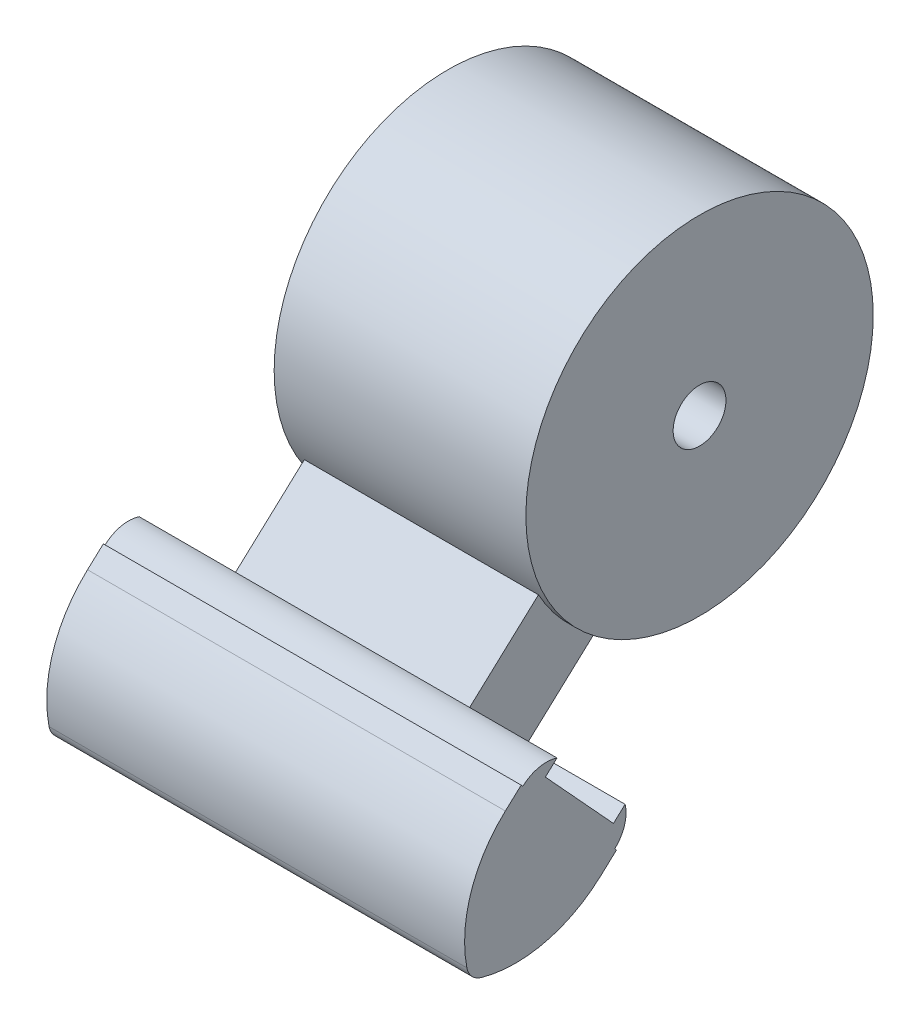
ISO-10303-21;
HEADER;
FILE_DESCRIPTION(('STEP AP214'),'2;1');
FILE_NAME('part.step','',(''),(''),'','','');
FILE_SCHEMA(('AUTOMOTIVE_DESIGN { 1 0 10303 214 1 1 1 1 }'));
ENDSEC;
DATA;
#1=APPLICATION_CONTEXT('core data for automotive mechanical design processes');
#2=APPLICATION_PROTOCOL_DEFINITION('international standard','automotive_design',2000,#1);
#3=PRODUCT_CONTEXT('',#1,'mechanical');
#4=PRODUCT('Part','Part','',(#3));
#5=PRODUCT_RELATED_PRODUCT_CATEGORY('part','',(#4));
#6=PRODUCT_DEFINITION_FORMATION('','',#4);
#7=PRODUCT_DEFINITION_CONTEXT('part definition',#1,'design');
#8=PRODUCT_DEFINITION('design','',#6,#7);
#9=PRODUCT_DEFINITION_SHAPE('','',#8);
#10=(LENGTH_UNIT() NAMED_UNIT(*) SI_UNIT(.MILLI.,.METRE.));
#11=(NAMED_UNIT(*) PLANE_ANGLE_UNIT() SI_UNIT($,.RADIAN.));
#12=(NAMED_UNIT(*) SI_UNIT($,.STERADIAN.) SOLID_ANGLE_UNIT());
#13=UNCERTAINTY_MEASURE_WITH_UNIT(LENGTH_MEASURE(1.E-05),#10,'distance_accuracy_value','');
#14=(GEOMETRIC_REPRESENTATION_CONTEXT(3) GLOBAL_UNCERTAINTY_ASSIGNED_CONTEXT((#13)) GLOBAL_UNIT_ASSIGNED_CONTEXT((#10,
#11,#12)) REPRESENTATION_CONTEXT('',''));
#15=CARTESIAN_POINT('',(0.,0.,0.));
#16=DIRECTION('',(0.,0.,1.));
#17=DIRECTION('',(1.,0.,0.));
#18=AXIS2_PLACEMENT_3D('',#15,#16,#17);
#19=CARTESIAN_POINT('',(1.050063098956,28.9739788111902,0.383786811994563));
#20=DIRECTION('',(0.,0.676118342877555,-0.736793041786165));
#21=DIRECTION('',(0.,0.736793041786165,0.676118342877555));
#22=AXIS2_PLACEMENT_3D('',#19,#20,#21);
#23=PLANE('',#22);
#24=DIRECTION('',(-1.,0.,0.));
#25=VECTOR('',#24,1.);
#26=CARTESIAN_POINT('',(1.050063098956,28.973978811191,0.383786811995052));
#27=LINE('',#26,#25);
#28=CARTESIAN_POINT('',(1.050063098956,28.9739788111909,0.383786811995115));
#29=VERTEX_POINT('',#28);
#30=CARTESIAN_POINT('',(17.650063098956,28.9739788111909,0.383786811995115));
#31=VERTEX_POINT('',#30);
#32=EDGE_CURVE('E139',#29,#31,#27,.F.);
#33=ORIENTED_EDGE('',*,*,#32,.F.);
#34=DIRECTION('',(0.,0.736793041786165,0.676118342877555));
#35=VECTOR('',#34,1.);
#36=CARTESIAN_POINT('',(1.050063098956,28.9739788111902,0.383786811994563));
#37=LINE('',#36,#35);
#38=CARTESIAN_POINT('',(1.050063098956,29.0476581153687,0.45139864628238));
#39=VERTEX_POINT('',#38);
#40=EDGE_CURVE('E148',#29,#39,#37,.T.);
#41=ORIENTED_EDGE('',*,*,#40,.T.);
#42=DIRECTION('',(1.,0.,0.));
#43=VECTOR('',#42,1.);
#44=CARTESIAN_POINT('',(1.050063098956,29.0476581153686,0.451398646282431));
#45=LINE('',#44,#43);
#46=CARTESIAN_POINT('',(17.650063098956,29.0476581153687,0.45139864628238));
#47=VERTEX_POINT('',#46);
#48=EDGE_CURVE('E158',#47,#39,#45,.F.);
#49=ORIENTED_EDGE('',*,*,#48,.F.);
#50=DIRECTION('',(0.,0.736793041786165,0.676118342877555));
#51=VECTOR('',#50,1.);
#52=CARTESIAN_POINT('',(17.650063098956,28.9739788111902,0.383786811994563));
#53=LINE('',#52,#51);
#54=EDGE_CURVE('E152',#47,#31,#53,.F.);
#55=ORIENTED_EDGE('',*,*,#54,.T.);
#56=EDGE_LOOP('',(#33,#41,#49,#55));
#57=FACE_BOUND('',#56,.T.);
#58=ADVANCED_FACE('F16',(#57),#23,.T.);
#59=CARTESIAN_POINT('',(1.050063098956,24.9216170813654,-3.33486407383129));
#60=DIRECTION('',(0.,0.676118342877555,-0.736793041786165));
#61=DIRECTION('',(0.,0.736793041786165,0.676118342877555));
#62=AXIS2_PLACEMENT_3D('',#59,#60,#61);
#63=PLANE('',#62);
#64=DIRECTION('',(1.,0.,0.));
#65=VECTOR('',#64,1.);
#66=CARTESIAN_POINT('',(1.050063098956,24.9216170813658,-3.33486407383002));
#67=LINE('',#66,#65);
#68=CARTESIAN_POINT('',(1.050063098956,24.9216170813657,-3.33486407383045));
#69=VERTEX_POINT('',#68);
#70=CARTESIAN_POINT('',(17.650063098956,24.9216170813657,-3.33486407383045));
#71=VERTEX_POINT('',#70);
#72=EDGE_CURVE('E164',#69,#71,#67,.T.);
#73=ORIENTED_EDGE('',*,*,#72,.F.);
#74=DIRECTION('',(0.,0.736793041786165,0.676118342877555));
#75=VECTOR('',#74,1.);
#76=CARTESIAN_POINT('',(1.050063098956,24.9216170813654,-3.33486407383129));
#77=LINE('',#76,#75);
#78=CARTESIAN_POINT('',(1.050063098956,24.995296385544,-3.26725223954586));
#79=VERTEX_POINT('',#78);
#80=EDGE_CURVE('E168',#69,#79,#77,.T.);
#81=ORIENTED_EDGE('',*,*,#80,.T.);
#82=DIRECTION('',(-1.,0.,0.));
#83=VECTOR('',#82,1.);
#84=CARTESIAN_POINT('',(1.050063098956,24.9952963855451,-3.2672522395471));
#85=LINE('',#84,#83);
#86=CARTESIAN_POINT('',(17.650063098956,24.995296385544,-3.26725223954586));
#87=VERTEX_POINT('',#86);
#88=EDGE_CURVE('E134',#87,#79,#85,.T.);
#89=ORIENTED_EDGE('',*,*,#88,.F.);
#90=DIRECTION('',(0.,0.736793041786165,0.676118342877555));
#91=VECTOR('',#90,1.);
#92=CARTESIAN_POINT('',(17.650063098956,24.9216170813654,-3.33486407383129));
#93=LINE('',#92,#91);
#94=EDGE_CURVE('E151',#87,#71,#93,.F.);
#95=ORIENTED_EDGE('',*,*,#94,.T.);
#96=EDGE_LOOP('',(#73,#81,#89,#95));
#97=FACE_BOUND('',#96,.T.);
#98=ADVANCED_FACE('F263',(#97),#63,.T.);
#99=CARTESIAN_POINT('',(1.050063098956,24.3453673432341,-2.70690182157172));
#100=DIRECTION('',(0.,-0.736793041786165,-0.676118342877555));
#101=DIRECTION('',(0.,0.676118342877555,-0.736793041786165));
#102=AXIS2_PLACEMENT_3D('',#99,#100,#101);
#103=PLANE('',#102);
#104=DIRECTION('',(-1.,0.,0.));
#105=VECTOR('',#104,1.);
#106=CARTESIAN_POINT('',(1.050063098956,24.345367343216,-2.70690182155276));
#107=LINE('',#106,#105);
#108=CARTESIAN_POINT('',(1.050063098956,24.3453673432248,-2.70690182156195));
#109=VERTEX_POINT('',#108);
#110=CARTESIAN_POINT('',(17.650063098956,24.3453673432248,-2.70690182156195));
#111=VERTEX_POINT('',#110);
#112=EDGE_CURVE('E117',#109,#111,#107,.F.);
#113=ORIENTED_EDGE('',*,*,#112,.F.);
#114=DIRECTION('',(0.,0.676118342877555,-0.736793041786165));
#115=VECTOR('',#114,1.);
#116=CARTESIAN_POINT('',(1.050063098956,24.3453673432341,-2.70690182157172));
#117=LINE('',#116,#115);
#118=EDGE_CURVE('E242',#109,#69,#117,.T.);
#119=ORIENTED_EDGE('',*,*,#118,.T.);
#120=ORIENTED_EDGE('',*,*,#72,.T.);
#121=DIRECTION('',(0.,0.676118342877555,-0.736793041786165));
#122=VECTOR('',#121,1.);
#123=CARTESIAN_POINT('',(17.650063098956,24.3453673432341,-2.70690182157172));
#124=LINE('',#123,#122);
#125=EDGE_CURVE('E167',#71,#111,#124,.F.);
#126=ORIENTED_EDGE('',*,*,#125,.T.);
#127=EDGE_LOOP('',(#113,#119,#120,#126));
#128=FACE_BOUND('',#127,.T.);
#129=ADVANCED_FACE('F550',(#128),#103,.T.);
#130=CARTESIAN_POINT('',(1.050063098956,29.0476581153686,0.451398646282431));
#131=DIRECTION('',(0.,0.736793041786165,0.676118342877555));
#132=DIRECTION('',(0.,-0.676118342877555,0.736793041786165));
#133=AXIS2_PLACEMENT_3D('',#130,#131,#132);
#134=PLANE('',#133);
#135=ORIENTED_EDGE('',*,*,#48,.T.);
#136=DIRECTION('',(0.,-0.676118342877555,0.736793041786165));
#137=VECTOR('',#136,1.);
#138=CARTESIAN_POINT('',(1.050063098956,29.0476581153686,0.451398646282431));
#139=LINE('',#138,#137);
#140=CARTESIAN_POINT('',(1.050063098956,28.4714083772355,1.07936089854193));
#141=VERTEX_POINT('',#140);
#142=EDGE_CURVE('E109',#39,#141,#139,.T.);
#143=ORIENTED_EDGE('',*,*,#142,.T.);
#144=DIRECTION('',(-1.,0.,0.));
#145=VECTOR('',#144,1.);
#146=CARTESIAN_POINT('',(1.050063098956,28.471408377237,1.07936089853991));
#147=LINE('',#146,#145);
#148=CARTESIAN_POINT('',(17.650063098956,28.4714083772355,1.07936089854193));
#149=VERTEX_POINT('',#148);
#150=EDGE_CURVE('E116',#149,#141,#147,.T.);
#151=ORIENTED_EDGE('',*,*,#150,.F.);
#152=DIRECTION('',(0.,-0.676118342877555,0.736793041786165));
#153=VECTOR('',#152,1.);
#154=CARTESIAN_POINT('',(17.650063098956,29.0476581153686,0.451398646282431));
#155=LINE('',#154,#153);
#156=EDGE_CURVE('E161',#149,#47,#155,.F.);
#157=ORIENTED_EDGE('',*,*,#156,.T.);
#158=EDGE_LOOP('',(#135,#143,#151,#157));
#159=FACE_BOUND('',#158,.T.);
#160=ADVANCED_FACE('F288',(#159),#134,.T.);
#161=CARTESIAN_POINT('',(17.70510978832,23.9894333394197,1.82226046133782));
#162=DIRECTION('',(1.,0.,0.));
#163=DIRECTION('',(0.,0.,-1.));
#164=AXIS2_PLACEMENT_3D('',#161,#162,#163);
#165=CYLINDRICAL_SURFACE('',#164,0.8);
#166=DIRECTION('',(-1.,0.,0.));
#167=VECTOR('',#166,1.);
#168=CARTESIAN_POINT('',(1.050063098956,23.8374314672666,2.6076873712816));
#169=LINE('',#168,#167);
#170=CARTESIAN_POINT('',(1.050063098956,23.837431467259,2.60768737127953));
#171=VERTEX_POINT('',#170);
#172=CARTESIAN_POINT('',(17.650063098956,23.837431467259,2.60768737127953));
#173=VERTEX_POINT('',#172);
#174=EDGE_CURVE('E128',#171,#173,#169,.F.);
#175=ORIENTED_EDGE('',*,*,#174,.F.);
#176=CARTESIAN_POINT('',(1.050063098956,23.9894333394197,1.82226046133782));
#177=DIRECTION('',(1.,0.,0.));
#178=DIRECTION('',(0.,0.,-1.));
#179=AXIS2_PLACEMENT_3D('',#176,#177,#178);
#180=CIRCLE('',#179,0.8);
#181=CARTESIAN_POINT('',(1.050063098956,23.2199287274706,2.04103580772868));
#182=VERTEX_POINT('',#181);
#183=EDGE_CURVE('E108',#171,#182,#180,.T.);
#184=ORIENTED_EDGE('',*,*,#183,.T.);
#185=DIRECTION('',(-1.,0.,0.));
#186=VECTOR('',#185,1.);
#187=CARTESIAN_POINT('',(1.050063098956,23.2199287274726,2.04103580773452));
#188=LINE('',#187,#186);
#189=CARTESIAN_POINT('',(17.650063098956,23.2199287274706,2.04103580772868));
#190=VERTEX_POINT('',#189);
#191=EDGE_CURVE('E111',#190,#182,#188,.T.);
#192=ORIENTED_EDGE('',*,*,#191,.F.);
#193=CARTESIAN_POINT('',(17.650063098956,23.9894333394197,1.82226046133782));
#194=DIRECTION('',(1.,0.,0.));
#195=DIRECTION('',(0.,0.,-1.));
#196=AXIS2_PLACEMENT_3D('',#193,#194,#195);
#197=CIRCLE('',#196,0.8);
#198=EDGE_CURVE('E19',#190,#173,#197,.F.);
#199=ORIENTED_EDGE('',*,*,#198,.T.);
#200=EDGE_LOOP('',(#175,#184,#192,#199));
#201=FACE_BOUND('',#200,.T.);
#202=ADVANCED_FACE('F112',(#201),#165,.T.);
#203=CARTESIAN_POINT('',(1.050063098956,27.9582569750147,-0.548290617828714));
#204=DIRECTION('',(-1.,0.,0.));
#205=DIRECTION('',(0.,0.,1.));
#206=AXIS2_PLACEMENT_3D('',#203,#204,#205);
#207=CYLINDRICAL_SURFACE('',#206,1.378571428571);
#208=DIRECTION('',(1.,0.,0.));
#209=VECTOR('',#208,1.);
#210=CARTESIAN_POINT('',(1.050063098956,29.269565693393,-0.973647678162819));
#211=LINE('',#210,#209);
#212=CARTESIAN_POINT('',(1.050063098956,29.2695656933933,-0.973647678162653));
#213=VERTEX_POINT('',#212);
#214=CARTESIAN_POINT('',(17.650063098956,29.2695656933933,-0.973647678162653));
#215=VERTEX_POINT('',#214);
#216=EDGE_CURVE('E123',#213,#215,#211,.T.);
#217=ORIENTED_EDGE('',*,*,#216,.F.);
#218=CARTESIAN_POINT('',(1.050063098956,27.9582569750147,-0.548290617828714));
#219=DIRECTION('',(-1.,0.,0.));
#220=DIRECTION('',(0.,0.,1.));
#221=AXIS2_PLACEMENT_3D('',#218,#219,#220);
#222=CIRCLE('',#221,1.378571428571);
#223=EDGE_CURVE('E135',#213,#29,#222,.F.);
#224=ORIENTED_EDGE('',*,*,#223,.T.);
#225=ORIENTED_EDGE('',*,*,#32,.T.);
#226=CARTESIAN_POINT('',(17.650063098956,27.9582569750147,-0.548290617828714));
#227=DIRECTION('',(-1.,0.,0.));
#228=DIRECTION('',(0.,0.,1.));
#229=AXIS2_PLACEMENT_3D('',#226,#227,#228);
#230=CIRCLE('',#229,1.378571428571);
#231=EDGE_CURVE('E138',#31,#215,#230,.T.);
#232=ORIENTED_EDGE('',*,*,#231,.T.);
#233=EDGE_LOOP('',(#217,#224,#225,#232));
#234=FACE_BOUND('',#233,.T.);
#235=ADVANCED_FACE('F290',(#234),#207,.T.);
#236=CARTESIAN_POINT('',(1.050063098956,26.0110182217183,-2.33517480971998));
#237=DIRECTION('',(-1.,0.,0.));
#238=DIRECTION('',(0.,0.,1.));
#239=AXIS2_PLACEMENT_3D('',#236,#237,#238);
#240=CYLINDRICAL_SURFACE('',#239,1.378571428571);
#241=ORIENTED_EDGE('',*,*,#88,.T.);
#242=CARTESIAN_POINT('',(1.050063098956,26.0110182217183,-2.33517480971998));
#243=DIRECTION('',(-1.,0.,0.));
#244=DIRECTION('',(0.,0.,1.));
#245=AXIS2_PLACEMENT_3D('',#242,#243,#244);
#246=CIRCLE('',#245,1.378571428571);
#247=CARTESIAN_POINT('',(1.050063098956,26.3223935262483,-3.67812104967182));
#248=VERTEX_POINT('',#247);
#249=EDGE_CURVE('E132',#79,#248,#246,.F.);
#250=ORIENTED_EDGE('',*,*,#249,.T.);
#251=DIRECTION('',(1.,0.,0.));
#252=VECTOR('',#251,1.);
#253=CARTESIAN_POINT('',(1.050063098956,26.3223935262478,-3.6781210496718));
#254=LINE('',#253,#252);
#255=CARTESIAN_POINT('',(17.650063098956,26.3223935262479,-3.67812104967192));
#256=VERTEX_POINT('',#255);
#257=EDGE_CURVE('E195',#256,#248,#254,.F.);
#258=ORIENTED_EDGE('',*,*,#257,.F.);
#259=CARTESIAN_POINT('',(17.650063098956,26.0110182217183,-2.33517480971998));
#260=DIRECTION('',(-1.,0.,0.));
#261=DIRECTION('',(0.,0.,1.));
#262=AXIS2_PLACEMENT_3D('',#259,#260,#261);
#263=CIRCLE('',#262,1.378571428571);
#264=EDGE_CURVE('E122',#87,#256,#263,.F.);
#265=ORIENTED_EDGE('',*,*,#264,.F.);
#266=EDGE_LOOP('',(#241,#250,#258,#265));
#267=FACE_BOUND('',#266,.T.);
#268=ADVANCED_FACE('F274',(#267),#240,.T.);
#269=CARTESIAN_POINT('',(1.050063098956,28.029332552164,0.673689892816268));
#270=DIRECTION('',(-1.,0.,0.));
#271=DIRECTION('',(0.,0.,1.));
#272=AXIS2_PLACEMENT_3D('',#269,#270,#271);
#273=CYLINDRICAL_SURFACE('',#272,5.);
#274=CARTESIAN_POINT('',(17.650063098956,28.029332552164,0.673689892816268));
#275=DIRECTION('',(-1.,0.,0.));
#276=DIRECTION('',(0.,0.,1.));
#277=AXIS2_PLACEMENT_3D('',#274,#275,#276);
#278=CIRCLE('',#277,5.);
#279=EDGE_CURVE('E102',#190,#111,#278,.F.);
#280=ORIENTED_EDGE('',*,*,#279,.F.);
#281=ORIENTED_EDGE('',*,*,#191,.T.);
#282=CARTESIAN_POINT('',(1.050063098956,28.029332552164,0.673689892816268));
#283=DIRECTION('',(-1.,0.,0.));
#284=DIRECTION('',(0.,0.,1.));
#285=AXIS2_PLACEMENT_3D('',#282,#283,#284);
#286=CIRCLE('',#285,5.);
#287=EDGE_CURVE('E193',#182,#109,#286,.F.);
#288=ORIENTED_EDGE('',*,*,#287,.T.);
#289=ORIENTED_EDGE('',*,*,#112,.T.);
#290=EDGE_LOOP('',(#280,#281,#288,#289));
#291=FACE_BOUND('',#290,.T.);
#292=ADVANCED_FACE('F120',(#291),#273,.T.);
#293=CARTESIAN_POINT('',(1.050063098956,24.7874431683028,-2.30123081584418));
#294=DIRECTION('',(-1.,0.,0.));
#295=DIRECTION('',(0.,0.,1.));
#296=AXIS2_PLACEMENT_3D('',#293,#294,#295);
#297=CYLINDRICAL_SURFACE('',#296,5.);
#298=CARTESIAN_POINT('',(1.050063098956,24.7874431683028,-2.30123081584418));
#299=DIRECTION('',(-1.,0.,0.));
#300=DIRECTION('',(0.,0.,1.));
#301=AXIS2_PLACEMENT_3D('',#298,#299,#300);
#302=CIRCLE('',#301,5.);
#303=EDGE_CURVE('E188',#141,#171,#302,.F.);
#304=ORIENTED_EDGE('',*,*,#303,.T.);
#305=ORIENTED_EDGE('',*,*,#174,.T.);
#306=CARTESIAN_POINT('',(17.650063098956,24.7874431683028,-2.30123081584418));
#307=DIRECTION('',(-1.,0.,0.));
#308=DIRECTION('',(0.,0.,1.));
#309=AXIS2_PLACEMENT_3D('',#306,#307,#308);
#310=CIRCLE('',#309,5.);
#311=EDGE_CURVE('E104',#149,#173,#310,.F.);
#312=ORIENTED_EDGE('',*,*,#311,.F.);
#313=ORIENTED_EDGE('',*,*,#150,.T.);
#314=EDGE_LOOP('',(#304,#305,#312,#313));
#315=FACE_BOUND('',#314,.T.);
#316=ADVANCED_FACE('F500',(#315),#297,.T.);
#317=CARTESIAN_POINT('',(1.050063098956,28.8436111373799,-0.509468061837339));
#318=DIRECTION('',(0.,-0.736793041786165,-0.676118342877555));
#319=DIRECTION('',(0.,0.676118342877555,-0.736793041786165));
#320=AXIS2_PLACEMENT_3D('',#317,#318,#319);
#321=PLANE('',#320);
#322=DIRECTION('',(1.,0.,0.));
#323=VECTOR('',#322,1.);
#324=CARTESIAN_POINT('',(1.050063098956,28.8436111373791,-0.509468061836153));
#325=LINE('',#324,#323);
#326=CARTESIAN_POINT('',(1.050063098956,28.8436111373791,-0.509468061836189));
#327=VERTEX_POINT('',#326);
#328=CARTESIAN_POINT('',(17.650063098956,28.8436111373791,-0.509468061836184));
#329=VERTEX_POINT('',#328);
#330=EDGE_CURVE('E191',#327,#329,#325,.T.);
#331=ORIENTED_EDGE('',*,*,#330,.F.);
#332=DIRECTION('',(0.,0.676118342878122,-0.736793041785644));
#333=VECTOR('',#332,1.);
#334=CARTESIAN_POINT('',(1.050063098956,28.8436111373791,-0.50946806183619));
#335=LINE('',#334,#333);
#336=EDGE_CURVE('E192',#327,#213,#335,.T.);
#337=ORIENTED_EDGE('',*,*,#336,.T.);
#338=ORIENTED_EDGE('',*,*,#216,.T.);
#339=DIRECTION('',(0.,0.676118342878122,-0.736793041785644));
#340=VECTOR('',#339,1.);
#341=CARTESIAN_POINT('',(17.650063098956,28.8436111373791,-0.50946806183619));
#342=LINE('',#341,#340);
#343=EDGE_CURVE('E125',#329,#215,#342,.T.);
#344=ORIENTED_EDGE('',*,*,#343,.F.);
#345=EDGE_LOOP('',(#331,#337,#338,#344));
#346=FACE_BOUND('',#345,.T.);
#347=ADVANCED_FACE('F294',(#346),#321,.T.);
#348=CARTESIAN_POINT('',(17.650063098956,34.91912593735,-9.935202041078));
#349=DIRECTION('',(1.,0.,0.));
#350=DIRECTION('',(0.,0.,-1.));
#351=AXIS2_PLACEMENT_3D('',#348,#349,#350);
#352=PLANE('',#351);
#353=ORIENTED_EDGE('',*,*,#311,.T.);
#354=ORIENTED_EDGE('',*,*,#198,.F.);
#355=ORIENTED_EDGE('',*,*,#279,.T.);
#356=ORIENTED_EDGE('',*,*,#125,.F.);
#357=ORIENTED_EDGE('',*,*,#94,.F.);
#358=ORIENTED_EDGE('',*,*,#264,.T.);
#359=DIRECTION('',(0.,-0.676118342877555,0.736793041786165));
#360=VECTOR('',#359,1.);
#361=CARTESIAN_POINT('',(17.650063098956,26.3223935262487,-3.67812104967283));
#362=LINE('',#361,#360);
#363=CARTESIAN_POINT('',(17.650063098956,25.8964389702341,-3.2139414333464));
#364=VERTEX_POINT('',#363);
#365=EDGE_CURVE('E196',#364,#256,#362,.F.);
#366=ORIENTED_EDGE('',*,*,#365,.F.);
#367=DIRECTION('',(0.,0.736793041786165,0.676118342877555));
#368=VECTOR('',#367,1.);
#369=CARTESIAN_POINT('',(17.650063098956,25.8964389702332,-3.21394143334747));
#370=LINE('',#369,#368);
#371=EDGE_CURVE('E215',#329,#364,#370,.F.);
#372=ORIENTED_EDGE('',*,*,#371,.F.);
#373=ORIENTED_EDGE('',*,*,#343,.T.);
#374=ORIENTED_EDGE('',*,*,#231,.F.);
#375=ORIENTED_EDGE('',*,*,#54,.F.);
#376=ORIENTED_EDGE('',*,*,#156,.F.);
#377=EDGE_LOOP('',(#353,#354,#355,#356,#357,#358,#366,#372,#373,#374,#375,#376));
#378=FACE_BOUND('',#377,.T.);
#379=ADVANCED_FACE('F99',(#378),#352,.T.);
#380=CARTESIAN_POINT('',(1.050063098956,26.3223935262487,-3.67812104967283));
#381=DIRECTION('',(0.,0.736793041786165,0.676118342877555));
#382=DIRECTION('',(0.,-0.676118342877555,0.736793041786165));
#383=AXIS2_PLACEMENT_3D('',#380,#381,#382);
#384=PLANE('',#383);
#385=ORIENTED_EDGE('',*,*,#257,.T.);
#386=DIRECTION('',(0.,-0.676118342879761,0.736793041784141));
#387=VECTOR('',#386,1.);
#388=CARTESIAN_POINT('',(1.050063098956,26.3223935262489,-3.67812104967185));
#389=LINE('',#388,#387);
#390=CARTESIAN_POINT('',(1.050063098956,25.8964389702338,-3.21394143334653));
#391=VERTEX_POINT('',#390);
#392=EDGE_CURVE('E194',#248,#391,#389,.T.);
#393=ORIENTED_EDGE('',*,*,#392,.T.);
#394=DIRECTION('',(1.,0.,0.));
#395=VECTOR('',#394,1.);
#396=CARTESIAN_POINT('',(1.050063098956,25.8964389702338,-3.21394143334694));
#397=LINE('',#396,#395);
#398=EDGE_CURVE('E222',#364,#391,#397,.F.);
#399=ORIENTED_EDGE('',*,*,#398,.F.);
#400=ORIENTED_EDGE('',*,*,#365,.T.);
#401=EDGE_LOOP('',(#385,#393,#399,#400));
#402=FACE_BOUND('',#401,.T.);
#403=ADVANCED_FACE('F474',(#402),#384,.T.);
#404=CARTESIAN_POINT('',(1.050063098956,34.91912593735,-9.935202041078));
#405=DIRECTION('',(1.,0.,0.));
#406=DIRECTION('',(0.,0.,-1.));
#407=AXIS2_PLACEMENT_3D('',#404,#405,#406);
#408=PLANE('',#407);
#409=ORIENTED_EDGE('',*,*,#142,.F.);
#410=ORIENTED_EDGE('',*,*,#40,.F.);
#411=ORIENTED_EDGE('',*,*,#223,.F.);
#412=ORIENTED_EDGE('',*,*,#336,.F.);
#413=DIRECTION('',(0.,0.736793041786165,0.676118342877555));
#414=VECTOR('',#413,1.);
#415=CARTESIAN_POINT('',(1.050063098956,25.8964389702332,-3.21394143334747));
#416=LINE('',#415,#414);
#417=EDGE_CURVE('E218',#391,#327,#416,.T.);
#418=ORIENTED_EDGE('',*,*,#417,.F.);
#419=ORIENTED_EDGE('',*,*,#392,.F.);
#420=ORIENTED_EDGE('',*,*,#249,.F.);
#421=ORIENTED_EDGE('',*,*,#80,.F.);
#422=ORIENTED_EDGE('',*,*,#118,.F.);
#423=ORIENTED_EDGE('',*,*,#287,.F.);
#424=ORIENTED_EDGE('',*,*,#183,.F.);
#425=ORIENTED_EDGE('',*,*,#303,.F.);
#426=EDGE_LOOP('',(#409,#410,#411,#412,#418,#419,#420,#421,#422,#423,#424,#425));
#427=FACE_BOUND('',#426,.T.);
#428=ADVANCED_FACE('F269',(#427),#408,.F.);
#429=CARTESIAN_POINT('',(1.050063098956,25.8964389702332,-3.21394143334747));
#430=DIRECTION('',(0.,0.676118342877555,-0.736793041786165));
#431=DIRECTION('',(0.,0.736793041786165,0.676118342877555));
#432=AXIS2_PLACEMENT_3D('',#429,#430,#431);
#433=PLANE('',#432);
#434=DIRECTION('',(0.,-0.736793041786275,-0.676118342877434));
#435=VECTOR('',#434,1.);
#436=CARTESIAN_POINT('',(4.700063098956,28.6594128769346,-0.678497647555615));
#437=LINE('',#436,#435);
#438=CARTESIAN_POINT('',(4.700063098956,28.6594128769346,-0.678497647555606));
#439=VERTEX_POINT('',#438);
#440=CARTESIAN_POINT('',(4.700063098956,26.2279958390402,-2.90968817905121));
#441=VERTEX_POINT('',#440);
#442=EDGE_CURVE('E303',#439,#441,#437,.T.);
#443=ORIENTED_EDGE('',*,*,#442,.T.);
#444=DIRECTION('',(1.,0.,0.));
#445=VECTOR('',#444,1.);
#446=CARTESIAN_POINT('',(1.050063098956,26.2279958390409,-2.90968817905132));
#447=LINE('',#446,#445);
#448=CARTESIAN_POINT('',(14.000063098956,26.2279958390409,-2.90968817905132));
#449=VERTEX_POINT('',#448);
#450=EDGE_CURVE('E221',#449,#441,#447,.F.);
#451=ORIENTED_EDGE('',*,*,#450,.F.);
#452=DIRECTION('',(0.,-0.736793041786114,-0.67611834287761));
#453=VECTOR('',#452,1.);
#454=CARTESIAN_POINT('',(14.000063098956,28.6594128769346,-0.678497647555615));
#455=LINE('',#454,#453);
#456=CARTESIAN_POINT('',(14.000063098956,28.6594128769346,-0.678497647555612));
#457=VERTEX_POINT('',#456);
#458=EDGE_CURVE('E314',#457,#449,#455,.T.);
#459=ORIENTED_EDGE('',*,*,#458,.F.);
#460=DIRECTION('',(1.,0.,0.));
#461=VECTOR('',#460,1.);
#462=CARTESIAN_POINT('',(1.050063098956,28.6594128769346,-0.678497647555606));
#463=LINE('',#462,#461);
#464=EDGE_CURVE('E309',#439,#457,#463,.T.);
#465=ORIENTED_EDGE('',*,*,#464,.F.);
#466=EDGE_LOOP('',(#443,#451,#459,#465));
#467=FACE_BOUND('',#466,.T.);
#468=ORIENTED_EDGE('',*,*,#398,.T.);
#469=ORIENTED_EDGE('',*,*,#417,.T.);
#470=ORIENTED_EDGE('',*,*,#330,.T.);
#471=ORIENTED_EDGE('',*,*,#371,.T.);
#472=EDGE_LOOP('',(#468,#469,#470,#471));
#473=FACE_BOUND('',#472,.T.);
#474=ADVANCED_FACE('F358',(#467,#473),#433,.T.);
#475=CARTESIAN_POINT('',(1.050063098956,26.2279958390409,-2.90968817905132));
#476=DIRECTION('',(0.,-0.736793041786165,-0.676118342877555));
#477=DIRECTION('',(0.,0.676118342877555,-0.736793041786165));
#478=AXIS2_PLACEMENT_3D('',#475,#476,#477);
#479=PLANE('',#478);
#480=ORIENTED_EDGE('',*,*,#450,.T.);
#481=DIRECTION('',(0.,0.676118342877569,-0.736793041786152));
#482=VECTOR('',#481,1.);
#483=CARTESIAN_POINT('',(4.700063098956,26.2279958390399,-2.90968817905116));
#484=LINE('',#483,#482);
#485=CARTESIAN_POINT('',(4.700063098956,29.1715636598076,-6.11741107433145));
#486=VERTEX_POINT('',#485);
#487=EDGE_CURVE('E306',#441,#486,#484,.T.);
#488=ORIENTED_EDGE('',*,*,#487,.T.);
#489=DIRECTION('',(-1.,0.,0.));
#490=VECTOR('',#489,1.);
#491=CARTESIAN_POINT('',(17.650063098956,29.1715636598076,-6.11741107433151));
#492=LINE('',#491,#490);
#493=CARTESIAN_POINT('',(14.000063098956,29.1715636598076,-6.11741107433145));
#494=VERTEX_POINT('',#493);
#495=EDGE_CURVE('E183',#494,#486,#492,.T.);
#496=ORIENTED_EDGE('',*,*,#495,.F.);
#497=DIRECTION('',(0.,0.676118342877465,-0.736793041786247));
#498=VECTOR('',#497,1.);
#499=CARTESIAN_POINT('',(14.000063098956,26.2279958390409,-2.90968817905132));
#500=LINE('',#499,#498);
#501=EDGE_CURVE('E187',#449,#494,#500,.T.);
#502=ORIENTED_EDGE('',*,*,#501,.F.);
#503=EDGE_LOOP('',(#480,#488,#496,#502));
#504=FACE_BOUND('',#503,.T.);
#505=ADVANCED_FACE('F362',(#504),#479,.T.);
#506=CARTESIAN_POINT('',(4.700063098956,34.91912593735,-9.935202041078));
#507=DIRECTION('',(1.,0.,0.));
#508=DIRECTION('',(0.,0.,-1.));
#509=AXIS2_PLACEMENT_3D('',#506,#507,#508);
#510=PLANE('',#509);
#511=CARTESIAN_POINT('',(4.700063098956,34.91912593735,-9.935202041078));
#512=DIRECTION('',(-1.,0.,0.));
#513=DIRECTION('',(0.,0.,1.));
#514=AXIS2_PLACEMENT_3D('',#511,#512,#513);
#515=CIRCLE('',#514,6.9);
#516=CARTESIAN_POINT('',(4.700063098956,31.6018199827701,-3.88495566562281));
#517=VERTEX_POINT('',#516);
#518=EDGE_CURVE('E180',#486,#517,#515,.T.);
#519=ORIENTED_EDGE('',*,*,#518,.F.);
#520=ORIENTED_EDGE('',*,*,#487,.F.);
#521=ORIENTED_EDGE('',*,*,#442,.F.);
#522=DIRECTION('',(0.,-0.676118342877555,0.736793041786165));
#523=VECTOR('',#522,1.);
#524=CARTESIAN_POINT('',(4.700063098956,31.6018199827709,-3.88495566562321));
#525=LINE('',#524,#523);
#526=EDGE_CURVE('E311',#517,#439,#525,.T.);
#527=ORIENTED_EDGE('',*,*,#526,.F.);
#528=EDGE_LOOP('',(#519,#520,#521,#527));
#529=FACE_BOUND('',#528,.T.);
#530=ADVANCED_FACE('F354',(#529),#510,.F.);
#531=CARTESIAN_POINT('',(1.050063098956,31.6018199827709,-3.88495566562321));
#532=DIRECTION('',(0.,0.736793041786165,0.676118342877555));
#533=DIRECTION('',(0.,-0.676118342877555,0.736793041786165));
#534=AXIS2_PLACEMENT_3D('',#531,#532,#533);
#535=PLANE('',#534);
#536=DIRECTION('',(-1.,0.,0.));
#537=VECTOR('',#536,1.);
#538=CARTESIAN_POINT('',(17.650063098956,31.6018199827698,-3.88495566562296));
#539=LINE('',#538,#537);
#540=CARTESIAN_POINT('',(14.000063098956,31.6018199827705,-3.88495566562262));
#541=VERTEX_POINT('',#540);
#542=EDGE_CURVE('E179',#517,#541,#539,.F.);
#543=ORIENTED_EDGE('',*,*,#542,.F.);
#544=ORIENTED_EDGE('',*,*,#526,.T.);
#545=ORIENTED_EDGE('',*,*,#464,.T.);
#546=DIRECTION('',(0.,-0.67611834287769,0.736793041786041));
#547=VECTOR('',#546,1.);
#548=CARTESIAN_POINT('',(14.000063098956,31.601819982771,-3.88495566562223));
#549=LINE('',#548,#547);
#550=EDGE_CURVE('E34',#541,#457,#549,.T.);
#551=ORIENTED_EDGE('',*,*,#550,.F.);
#552=EDGE_LOOP('',(#543,#544,#545,#551));
#553=FACE_BOUND('',#552,.T.);
#554=ADVANCED_FACE('F346',(#553),#535,.T.);
#555=CARTESIAN_POINT('',(14.000063098956,34.91912593735,-9.935202041078));
#556=DIRECTION('',(1.,0.,0.));
#557=DIRECTION('',(0.,0.,-1.));
#558=AXIS2_PLACEMENT_3D('',#555,#556,#557);
#559=PLANE('',#558);
#560=ORIENTED_EDGE('',*,*,#458,.T.);
#561=ORIENTED_EDGE('',*,*,#501,.T.);
#562=CARTESIAN_POINT('',(14.000063098956,34.91912593735,-9.935202041078));
#563=DIRECTION('',(-1.,0.,0.));
#564=DIRECTION('',(0.,0.,1.));
#565=AXIS2_PLACEMENT_3D('',#562,#563,#564);
#566=CIRCLE('',#565,6.9);
#567=EDGE_CURVE('E176',#541,#494,#566,.F.);
#568=ORIENTED_EDGE('',*,*,#567,.F.);
#569=ORIENTED_EDGE('',*,*,#550,.T.);
#570=EDGE_LOOP('',(#560,#561,#568,#569));
#571=FACE_BOUND('',#570,.T.);
#572=ADVANCED_FACE('F340',(#571),#559,.T.);
#573=CARTESIAN_POINT('',(14.350063098956,34.91912593735,-9.935202041078));
#574=DIRECTION('',(-1.,0.,0.));
#575=DIRECTION('',(0.,0.,1.));
#576=AXIS2_PLACEMENT_3D('',#573,#574,#575);
#577=CYLINDRICAL_SURFACE('',#576,1.05);
#578=CARTESIAN_POINT('',(14.350063098956,34.91912593735,-9.935202041078));
#579=DIRECTION('',(-1.,0.,0.));
#580=DIRECTION('',(0.,0.,1.));
#581=AXIS2_PLACEMENT_3D('',#578,#579,#580);
#582=CIRCLE('',#581,1.05);
#583=CARTESIAN_POINT('',(14.350063098956,34.91912593735,-8.885202041078));
#584=VERTEX_POINT('',#583);
#585=EDGE_CURVE('E184',#584,#584,#582,.F.);
#586=ORIENTED_EDGE('',*,*,#585,.T.);
#587=EDGE_LOOP('',(#586));
#588=FACE_BOUND('',#587,.T.);
#589=CARTESIAN_POINT('',(4.350063098956,34.91912593735,-9.935202041078));
#590=DIRECTION('',(-1.,0.,0.));
#591=DIRECTION('',(0.,0.,1.));
#592=AXIS2_PLACEMENT_3D('',#589,#590,#591);
#593=CIRCLE('',#592,1.05);
#594=CARTESIAN_POINT('',(4.350063098956,34.91912593735,-8.885202041078));
#595=VERTEX_POINT('',#594);
#596=EDGE_CURVE('E173',#595,#595,#593,.T.);
#597=ORIENTED_EDGE('',*,*,#596,.T.);
#598=EDGE_LOOP('',(#597));
#599=FACE_BOUND('',#598,.T.);
#600=ADVANCED_FACE('F386',(#588,#599),#577,.F.);
#601=CARTESIAN_POINT('',(14.350063098956,16.9058686392362,-14.609010521643));
#602=DIRECTION('',(-1.,0.,0.));
#603=DIRECTION('',(0.,0.,1.));
#604=AXIS2_PLACEMENT_3D('',#601,#602,#603);
#605=PLANE('',#604);
#606=ORIENTED_EDGE('',*,*,#585,.F.);
#607=EDGE_LOOP('',(#606));
#608=FACE_BOUND('',#607,.T.);
#609=CARTESIAN_POINT('',(14.350063098956,34.91912593735,-9.935202041078));
#610=DIRECTION('',(-1.,0.,0.));
#611=DIRECTION('',(0.,0.,1.));
#612=AXIS2_PLACEMENT_3D('',#609,#610,#611);
#613=CIRCLE('',#612,6.9);
#614=CARTESIAN_POINT('',(14.350063098956,34.91912593735,-3.035202041078));
#615=VERTEX_POINT('',#614);
#616=EDGE_CURVE('E25',#615,#615,#613,.T.);
#617=ORIENTED_EDGE('',*,*,#616,.F.);
#618=EDGE_LOOP('',(#617));
#619=FACE_BOUND('',#618,.T.);
#620=ADVANCED_FACE('F379',(#608,#619),#605,.F.);
#621=CARTESIAN_POINT('',(4.350063098956,28.6193543296705,-27.3736616255365));
#622=DIRECTION('',(1.,0.,0.));
#623=DIRECTION('',(0.,0.,-1.));
#624=AXIS2_PLACEMENT_3D('',#621,#622,#623);
#625=PLANE('',#624);
#626=ORIENTED_EDGE('',*,*,#596,.F.);
#627=EDGE_LOOP('',(#626));
#628=FACE_BOUND('',#627,.T.);
#629=CARTESIAN_POINT('',(4.350063098956,34.91912593735,-9.935202041078));
#630=DIRECTION('',(-1.,0.,0.));
#631=DIRECTION('',(0.,0.,1.));
#632=AXIS2_PLACEMENT_3D('',#629,#630,#631);
#633=CIRCLE('',#632,6.9);
#634=CARTESIAN_POINT('',(4.350063098956,34.91912593735,-3.035202041078));
#635=VERTEX_POINT('',#634);
#636=EDGE_CURVE('E11',#635,#635,#633,.F.);
#637=ORIENTED_EDGE('',*,*,#636,.F.);
#638=EDGE_LOOP('',(#637));
#639=FACE_BOUND('',#638,.T.);
#640=ADVANCED_FACE('F373',(#628,#639),#625,.F.);
#641=CARTESIAN_POINT('',(17.650063098956,34.91912593735,-9.935202041078));
#642=DIRECTION('',(-1.,0.,0.));
#643=DIRECTION('',(0.,0.,1.));
#644=AXIS2_PLACEMENT_3D('',#641,#642,#643);
#645=CYLINDRICAL_SURFACE('',#644,6.9);
#646=ORIENTED_EDGE('',*,*,#616,.T.);
#647=EDGE_LOOP('',(#646));
#648=FACE_BOUND('',#647,.T.);
#649=ORIENTED_EDGE('',*,*,#636,.T.);
#650=EDGE_LOOP('',(#649));
#651=FACE_BOUND('',#650,.T.);
#652=ORIENTED_EDGE('',*,*,#542,.T.);
#653=ORIENTED_EDGE('',*,*,#567,.T.);
#654=ORIENTED_EDGE('',*,*,#495,.T.);
#655=ORIENTED_EDGE('',*,*,#518,.T.);
#656=EDGE_LOOP('',(#652,#653,#654,#655));
#657=FACE_BOUND('',#656,.T.);
#658=ADVANCED_FACE('F344',(#648,#651,#657),#645,.T.);
#659=CLOSED_SHELL('',(#58,#98,#129,#160,#202,#235,#268,#292,#316,#347,#379,#403,#428,#474,#505,
#530,#554,#572,#600,#620,#640,#658));
#660=MANIFOLD_SOLID_BREP('B1',#659);
#661=ADVANCED_BREP_SHAPE_REPRESENTATION('',(#18,#660),#14);
#662=SHAPE_DEFINITION_REPRESENTATION(#9,#661);
ENDSEC;
END-ISO-10303-21;
